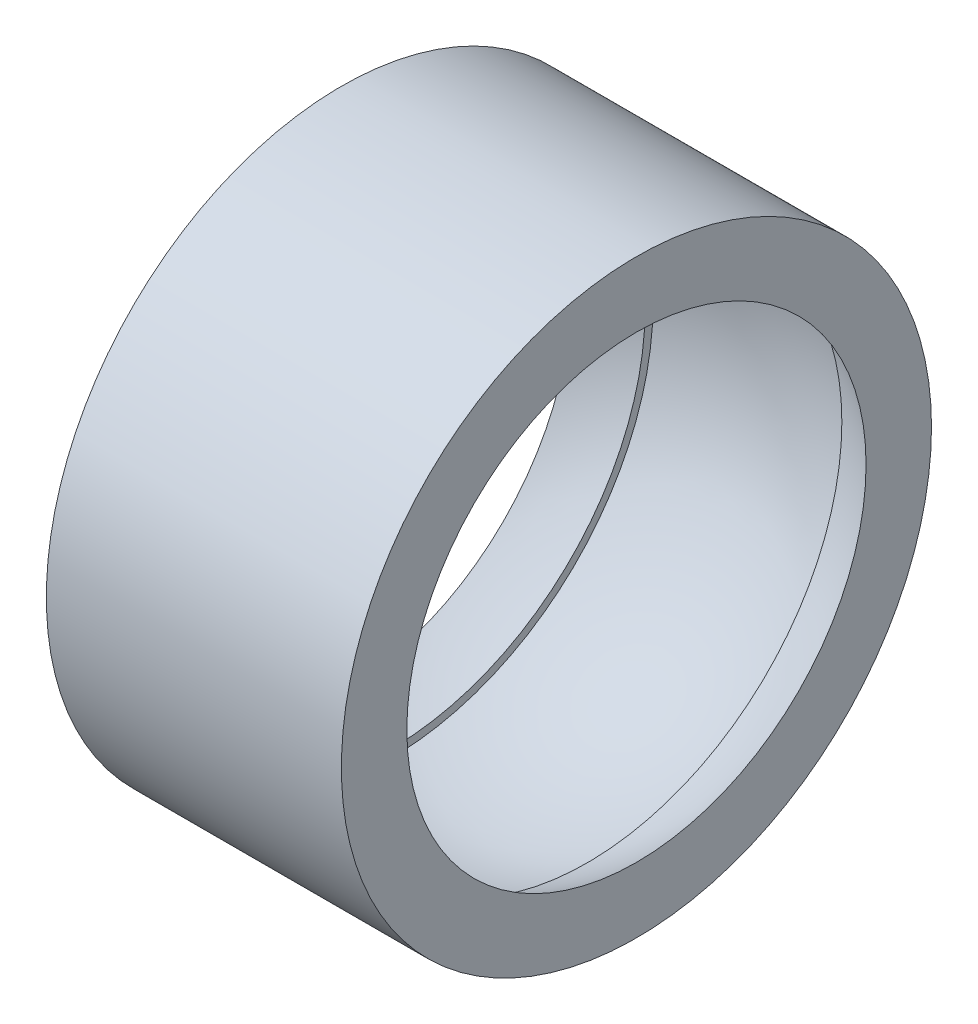
ISO-10303-21;
HEADER;
FILE_DESCRIPTION(('STEP AP214'),'2;1');
FILE_NAME('part.step','',(''),(''),'','','');
FILE_SCHEMA(('AUTOMOTIVE_DESIGN { 1 0 10303 214 1 1 1 1 }'));
ENDSEC;
DATA;
#1=APPLICATION_CONTEXT('core data for automotive mechanical design processes');
#2=APPLICATION_PROTOCOL_DEFINITION('international standard','automotive_design',2000,#1);
#3=PRODUCT_CONTEXT('',#1,'mechanical');
#4=PRODUCT('Part','Part','',(#3));
#5=PRODUCT_RELATED_PRODUCT_CATEGORY('part','',(#4));
#6=PRODUCT_DEFINITION_FORMATION('','',#4);
#7=PRODUCT_DEFINITION_CONTEXT('part definition',#1,'design');
#8=PRODUCT_DEFINITION('design','',#6,#7);
#9=PRODUCT_DEFINITION_SHAPE('','',#8);
#10=(LENGTH_UNIT() NAMED_UNIT(*) SI_UNIT(.MILLI.,.METRE.));
#11=(NAMED_UNIT(*) PLANE_ANGLE_UNIT() SI_UNIT($,.RADIAN.));
#12=(NAMED_UNIT(*) SI_UNIT($,.STERADIAN.) SOLID_ANGLE_UNIT());
#13=UNCERTAINTY_MEASURE_WITH_UNIT(LENGTH_MEASURE(1.E-05),#10,'distance_accuracy_value','');
#14=(GEOMETRIC_REPRESENTATION_CONTEXT(3) GLOBAL_UNCERTAINTY_ASSIGNED_CONTEXT((#13)) GLOBAL_UNIT_ASSIGNED_CONTEXT((#10,
#11,#12)) REPRESENTATION_CONTEXT('',''));
#15=CARTESIAN_POINT('',(0.,0.,0.));
#16=DIRECTION('',(0.,0.,1.));
#17=DIRECTION('',(1.,0.,0.));
#18=AXIS2_PLACEMENT_3D('',#15,#16,#17);
#19=CARTESIAN_POINT('',(0.,0.,0.));
#20=DIRECTION('',(1.,0.,0.));
#21=DIRECTION('',(0.,1.,0.));
#22=AXIS2_PLACEMENT_3D('',#19,#20,#21);
#23=SPHERICAL_SURFACE('',#22,11.1);
#24=CARTESIAN_POINT('',(-4.,0.,0.));
#25=DIRECTION('',(1.,0.,0.));
#26=DIRECTION('',(0.,0.,-1.));
#27=AXIS2_PLACEMENT_3D('',#24,#25,#26);
#28=CIRCLE('',#27,10.3542261903051);
#29=CARTESIAN_POINT('',(-4.,0.,-10.3542261903051));
#30=VERTEX_POINT('',#29);
#31=EDGE_CURVE('E56',#30,#30,#28,.T.);
#32=ORIENTED_EDGE('',*,*,#31,.T.);
#33=EDGE_LOOP('',(#32));
#34=FACE_BOUND('',#33,.T.);
#35=CARTESIAN_POINT('',(-6.00000000000001,0.,0.));
#36=DIRECTION('',(1.,0.,0.));
#37=DIRECTION('',(0.,0.,-1.));
#38=AXIS2_PLACEMENT_3D('',#35,#36,#37);
#39=CIRCLE('',#38,9.33862944976404);
#40=CARTESIAN_POINT('',(-6.00000000000001,0.,-9.33862944976404));
#41=VERTEX_POINT('',#40);
#42=EDGE_CURVE('E10',#41,#41,#39,.T.);
#43=ORIENTED_EDGE('',*,*,#42,.F.);
#44=EDGE_LOOP('',(#43));
#45=FACE_BOUND('',#44,.T.);
#46=ADVANCED_FACE('F28',(#34,#45),#23,.F.);
#47=CARTESIAN_POINT('',(-6.,12.,0.));
#48=DIRECTION('',(-1.,0.,0.));
#49=DIRECTION('',(0.,0.,1.));
#50=AXIS2_PLACEMENT_3D('',#47,#48,#49);
#51=PLANE('',#50);
#52=ORIENTED_EDGE('',*,*,#42,.T.);
#53=EDGE_LOOP('',(#52));
#54=FACE_BOUND('',#53,.T.);
#55=CARTESIAN_POINT('',(-6.,0.,0.));
#56=DIRECTION('',(1.,0.,0.));
#57=DIRECTION('',(0.,0.,-1.));
#58=AXIS2_PLACEMENT_3D('',#55,#56,#57);
#59=CIRCLE('',#58,12.);
#60=CARTESIAN_POINT('',(-6.,0.,-12.));
#61=VERTEX_POINT('',#60);
#62=EDGE_CURVE('E34',#61,#61,#59,.T.);
#63=ORIENTED_EDGE('',*,*,#62,.F.);
#64=EDGE_LOOP('',(#63));
#65=FACE_BOUND('',#64,.T.);
#66=ADVANCED_FACE('F74',(#54,#65),#51,.T.);
#67=CARTESIAN_POINT('',(48.3488833385327,0.,0.));
#68=DIRECTION('',(1.,0.,0.));
#69=DIRECTION('',(0.,0.,-1.));
#70=AXIS2_PLACEMENT_3D('',#67,#68,#69);
#71=CYLINDRICAL_SURFACE('',#70,12.);
#72=ORIENTED_EDGE('',*,*,#62,.T.);
#73=EDGE_LOOP('',(#72));
#74=FACE_BOUND('',#73,.T.);
#75=CARTESIAN_POINT('',(6.,0.,0.));
#76=DIRECTION('',(1.,0.,0.));
#77=DIRECTION('',(0.,0.,-1.));
#78=AXIS2_PLACEMENT_3D('',#75,#76,#77);
#79=CIRCLE('',#78,12.);
#80=CARTESIAN_POINT('',(6.,0.,-12.));
#81=VERTEX_POINT('',#80);
#82=EDGE_CURVE('E38',#81,#81,#79,.T.);
#83=ORIENTED_EDGE('',*,*,#82,.F.);
#84=EDGE_LOOP('',(#83));
#85=FACE_BOUND('',#84,.T.);
#86=ADVANCED_FACE('F78',(#74,#85),#71,.T.);
#87=CARTESIAN_POINT('',(6.,12.,0.));
#88=DIRECTION('',(1.,0.,0.));
#89=DIRECTION('',(0.,0.,-1.));
#90=AXIS2_PLACEMENT_3D('',#87,#88,#89);
#91=PLANE('',#90);
#92=ORIENTED_EDGE('',*,*,#82,.T.);
#93=EDGE_LOOP('',(#92));
#94=FACE_BOUND('',#93,.T.);
#95=CARTESIAN_POINT('',(6.00000000000001,0.,0.));
#96=DIRECTION('',(1.,0.,0.));
#97=DIRECTION('',(0.,0.,-1.));
#98=AXIS2_PLACEMENT_3D('',#95,#96,#97);
#99=CIRCLE('',#98,9.33862944976404);
#100=CARTESIAN_POINT('',(6.00000000000001,0.,-9.33862944976404));
#101=VERTEX_POINT('',#100);
#102=EDGE_CURVE('E42',#101,#101,#99,.T.);
#103=ORIENTED_EDGE('',*,*,#102,.F.);
#104=EDGE_LOOP('',(#103));
#105=FACE_BOUND('',#104,.T.);
#106=ADVANCED_FACE('F82',(#94,#105),#91,.T.);
#107=CARTESIAN_POINT('',(0.,0.,0.));
#108=DIRECTION('',(1.,0.,0.));
#109=DIRECTION('',(0.,1.,0.));
#110=AXIS2_PLACEMENT_3D('',#107,#108,#109);
#111=SPHERICAL_SURFACE('',#110,11.1);
#112=ORIENTED_EDGE('',*,*,#102,.T.);
#113=EDGE_LOOP('',(#112));
#114=FACE_BOUND('',#113,.T.);
#115=CARTESIAN_POINT('',(4.,0.,0.));
#116=DIRECTION('',(1.,0.,0.));
#117=DIRECTION('',(0.,0.,-1.));
#118=AXIS2_PLACEMENT_3D('',#115,#116,#117);
#119=CIRCLE('',#118,10.3542261903051);
#120=CARTESIAN_POINT('',(4.,0.,-10.3542261903051));
#121=VERTEX_POINT('',#120);
#122=EDGE_CURVE('E47',#121,#121,#119,.T.);
#123=ORIENTED_EDGE('',*,*,#122,.F.);
#124=EDGE_LOOP('',(#123));
#125=FACE_BOUND('',#124,.T.);
#126=ADVANCED_FACE('F88',(#114,#125),#111,.F.);
#127=CARTESIAN_POINT('',(4.,10.3542261903051,0.));
#128=DIRECTION('',(-1.,0.,0.));
#129=DIRECTION('',(0.,0.,1.));
#130=AXIS2_PLACEMENT_3D('',#127,#128,#129);
#131=PLANE('',#130);
#132=ORIENTED_EDGE('',*,*,#122,.T.);
#133=EDGE_LOOP('',(#132));
#134=FACE_BOUND('',#133,.T.);
#135=CARTESIAN_POINT('',(4.,0.,0.));
#136=DIRECTION('',(1.,0.,0.));
#137=DIRECTION('',(0.,0.,-1.));
#138=AXIS2_PLACEMENT_3D('',#135,#136,#137);
#139=CIRCLE('',#138,10.675204916066);
#140=CARTESIAN_POINT('',(4.,0.,-10.675204916066));
#141=VERTEX_POINT('',#140);
#142=EDGE_CURVE('E50',#141,#141,#139,.T.);
#143=ORIENTED_EDGE('',*,*,#142,.F.);
#144=EDGE_LOOP('',(#143));
#145=FACE_BOUND('',#144,.T.);
#146=ADVANCED_FACE('F70',(#134,#145),#131,.T.);
#147=CARTESIAN_POINT('',(0.,0.,0.));
#148=DIRECTION('',(1.,0.,0.));
#149=DIRECTION('',(0.,1.,0.));
#150=AXIS2_PLACEMENT_3D('',#147,#148,#149);
#151=SPHERICAL_SURFACE('',#150,11.4);
#152=ORIENTED_EDGE('',*,*,#142,.T.);
#153=EDGE_LOOP('',(#152));
#154=FACE_BOUND('',#153,.T.);
#155=CARTESIAN_POINT('',(-4.,0.,0.));
#156=DIRECTION('',(1.,0.,0.));
#157=DIRECTION('',(0.,0.,-1.));
#158=AXIS2_PLACEMENT_3D('',#155,#156,#157);
#159=CIRCLE('',#158,10.675204916066);
#160=CARTESIAN_POINT('',(-4.,0.,-10.675204916066));
#161=VERTEX_POINT('',#160);
#162=EDGE_CURVE('E53',#161,#161,#159,.T.);
#163=ORIENTED_EDGE('',*,*,#162,.F.);
#164=EDGE_LOOP('',(#163));
#165=FACE_BOUND('',#164,.T.);
#166=ADVANCED_FACE('F64',(#154,#165),#151,.F.);
#167=CARTESIAN_POINT('',(-4.,10.3542261903051,0.));
#168=DIRECTION('',(1.,0.,0.));
#169=DIRECTION('',(0.,0.,-1.));
#170=AXIS2_PLACEMENT_3D('',#167,#168,#169);
#171=PLANE('',#170);
#172=ORIENTED_EDGE('',*,*,#162,.T.);
#173=EDGE_LOOP('',(#172));
#174=FACE_BOUND('',#173,.T.);
#175=ORIENTED_EDGE('',*,*,#31,.F.);
#176=EDGE_LOOP('',(#175));
#177=FACE_BOUND('',#176,.T.);
#178=ADVANCED_FACE('F62',(#174,#177),#171,.T.);
#179=CLOSED_SHELL('',(#46,#66,#86,#106,#126,#146,#166,#178));
#180=MANIFOLD_SOLID_BREP('B2',#179);
#181=ADVANCED_BREP_SHAPE_REPRESENTATION('',(#18,#180),#14);
#182=SHAPE_DEFINITION_REPRESENTATION(#9,#181);
ENDSEC;
END-ISO-10303-21;
